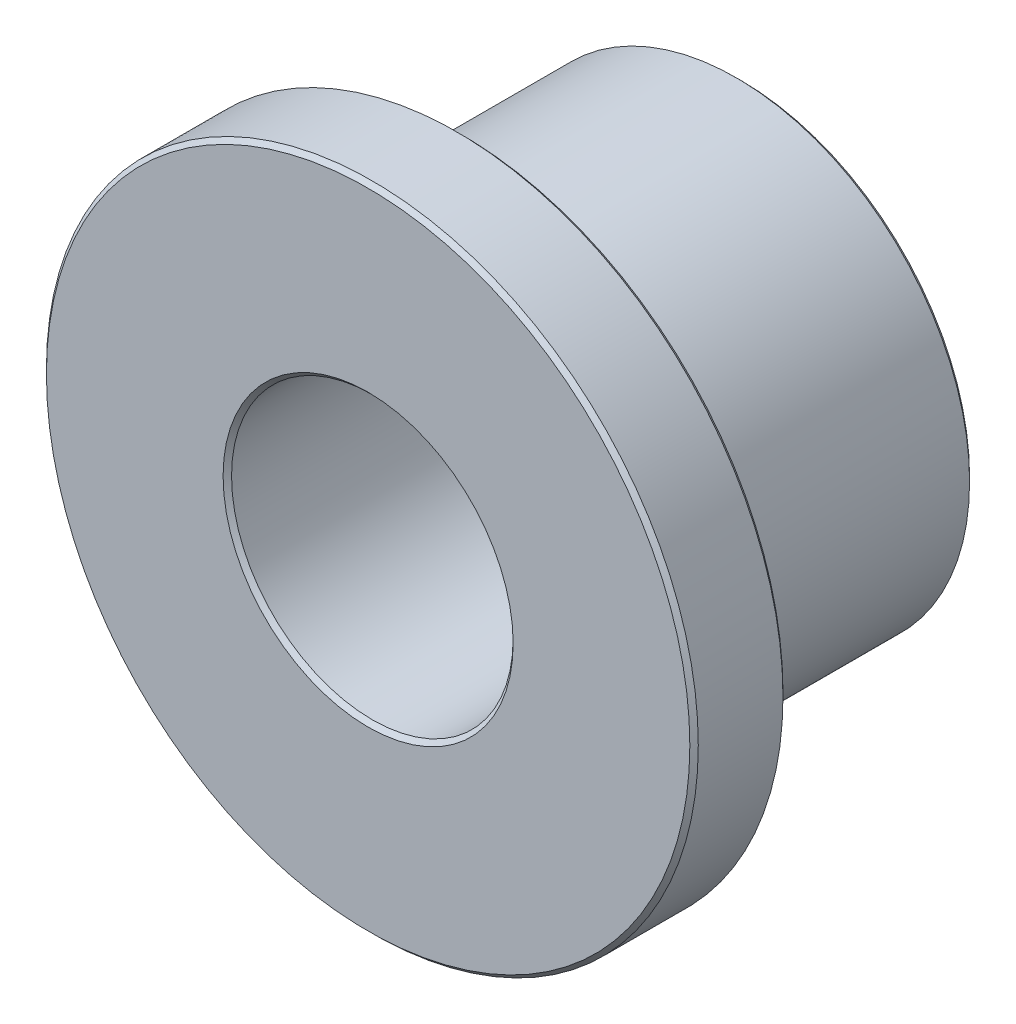
ISO-10303-21;
HEADER;
FILE_DESCRIPTION(('STEP AP214'),'2;1');
FILE_NAME('part.step','',(''),(''),'','','');
FILE_SCHEMA(('AUTOMOTIVE_DESIGN { 1 0 10303 214 1 1 1 1 }'));
ENDSEC;
DATA;
#1=APPLICATION_CONTEXT('core data for automotive mechanical design processes');
#2=APPLICATION_PROTOCOL_DEFINITION('international standard','automotive_design',2000,#1);
#3=PRODUCT_CONTEXT('',#1,'mechanical');
#4=PRODUCT('Part','Part','',(#3));
#5=PRODUCT_RELATED_PRODUCT_CATEGORY('part','',(#4));
#6=PRODUCT_DEFINITION_FORMATION('','',#4);
#7=PRODUCT_DEFINITION_CONTEXT('part definition',#1,'design');
#8=PRODUCT_DEFINITION('design','',#6,#7);
#9=PRODUCT_DEFINITION_SHAPE('','',#8);
#10=(LENGTH_UNIT() NAMED_UNIT(*) SI_UNIT(.MILLI.,.METRE.));
#11=(NAMED_UNIT(*) PLANE_ANGLE_UNIT() SI_UNIT($,.RADIAN.));
#12=(NAMED_UNIT(*) SI_UNIT($,.STERADIAN.) SOLID_ANGLE_UNIT());
#13=UNCERTAINTY_MEASURE_WITH_UNIT(LENGTH_MEASURE(1.E-05),#10,'distance_accuracy_value','');
#14=(GEOMETRIC_REPRESENTATION_CONTEXT(3) GLOBAL_UNCERTAINTY_ASSIGNED_CONTEXT((#13)) GLOBAL_UNIT_ASSIGNED_CONTEXT((#10,
#11,#12)) REPRESENTATION_CONTEXT('',''));
#15=CARTESIAN_POINT('',(0.,0.,0.));
#16=DIRECTION('',(0.,0.,1.));
#17=DIRECTION('',(1.,0.,0.));
#18=AXIS2_PLACEMENT_3D('',#15,#16,#17);
#19=CARTESIAN_POINT('',(0.,0.,1.5875));
#20=DIRECTION('',(0.,0.,1.));
#21=DIRECTION('',(1.,0.,0.));
#22=AXIS2_PLACEMENT_3D('',#19,#20,#21);
#23=CYLINDRICAL_SURFACE('',#22,5.55625);
#24=CARTESIAN_POINT('',(0.,0.,3.102991));
#25=DIRECTION('',(0.,0.,1.));
#26=DIRECTION('',(1.,0.,0.));
#27=AXIS2_PLACEMENT_3D('',#24,#25,#26);
#28=CIRCLE('',#27,5.55625);
#29=CARTESIAN_POINT('',(5.55625,0.,3.102991));
#30=VERTEX_POINT('',#29);
#31=EDGE_CURVE('E56',#30,#30,#28,.F.);
#32=ORIENTED_EDGE('',*,*,#31,.T.);
#33=EDGE_LOOP('',(#32));
#34=FACE_BOUND('',#33,.T.);
#35=CARTESIAN_POINT('',(0.,0.,1.659509));
#36=DIRECTION('',(0.,0.,1.));
#37=DIRECTION('',(1.,0.,0.));
#38=AXIS2_PLACEMENT_3D('',#35,#36,#37);
#39=CIRCLE('',#38,5.55625);
#40=CARTESIAN_POINT('',(5.55625,0.,1.659509));
#41=VERTEX_POINT('',#40);
#42=EDGE_CURVE('E59',#41,#41,#39,.T.);
#43=ORIENTED_EDGE('',*,*,#42,.T.);
#44=EDGE_LOOP('',(#43));
#45=FACE_BOUND('',#44,.T.);
#46=ADVANCED_FACE('F30',(#34,#45),#23,.T.);
#47=CARTESIAN_POINT('',(0.,0.,1.5875));
#48=DIRECTION('',(0.,0.,1.));
#49=DIRECTION('',(1.,0.,0.));
#50=AXIS2_PLACEMENT_3D('',#47,#48,#49);
#51=PLANE('',#50);
#52=CARTESIAN_POINT('',(0.,0.,1.5875));
#53=DIRECTION('',(0.,0.,1.));
#54=DIRECTION('',(1.,0.,0.));
#55=AXIS2_PLACEMENT_3D('',#52,#53,#54);
#56=CIRCLE('',#55,5.484241);
#57=CARTESIAN_POINT('',(5.484241,0.,1.5875));
#58=VERTEX_POINT('',#57);
#59=EDGE_CURVE('E50',#58,#58,#56,.F.);
#60=ORIENTED_EDGE('',*,*,#59,.T.);
#61=EDGE_LOOP('',(#60));
#62=FACE_BOUND('',#61,.T.);
#63=CARTESIAN_POINT('',(0.,0.,1.5875));
#64=DIRECTION('',(0.,0.,1.));
#65=DIRECTION('',(1.,0.,0.));
#66=AXIS2_PLACEMENT_3D('',#63,#64,#65);
#67=CIRCLE('',#66,4.047109);
#68=CARTESIAN_POINT('',(4.047109,0.,1.5875));
#69=VERTEX_POINT('',#68);
#70=EDGE_CURVE('E53',#69,#69,#67,.T.);
#71=ORIENTED_EDGE('',*,*,#70,.T.);
#72=EDGE_LOOP('',(#71));
#73=FACE_BOUND('',#72,.T.);
#74=ADVANCED_FACE('F90',(#62,#73),#51,.F.);
#75=CARTESIAN_POINT('',(0.,0.,3.175));
#76=DIRECTION('',(0.,0.,1.));
#77=DIRECTION('',(1.,0.,0.));
#78=AXIS2_PLACEMENT_3D('',#75,#76,#77);
#79=PLANE('',#78);
#80=CARTESIAN_POINT('',(0.,0.,3.175));
#81=DIRECTION('',(0.,0.,1.));
#82=DIRECTION('',(1.,0.,0.));
#83=AXIS2_PLACEMENT_3D('',#80,#81,#82);
#84=CIRCLE('',#83,2.472309);
#85=CARTESIAN_POINT('',(2.472309,0.,3.175));
#86=VERTEX_POINT('',#85);
#87=EDGE_CURVE('E62',#86,#86,#84,.F.);
#88=ORIENTED_EDGE('',*,*,#87,.T.);
#89=EDGE_LOOP('',(#88));
#90=FACE_BOUND('',#89,.T.);
#91=CARTESIAN_POINT('',(0.,0.,3.175));
#92=DIRECTION('',(0.,0.,1.));
#93=DIRECTION('',(1.,0.,0.));
#94=AXIS2_PLACEMENT_3D('',#91,#92,#93);
#95=CIRCLE('',#94,5.484241);
#96=CARTESIAN_POINT('',(5.484241,0.,3.175));
#97=VERTEX_POINT('',#96);
#98=EDGE_CURVE('E65',#97,#97,#95,.T.);
#99=ORIENTED_EDGE('',*,*,#98,.T.);
#100=EDGE_LOOP('',(#99));
#101=FACE_BOUND('',#100,.T.);
#102=ADVANCED_FACE('F96',(#90,#101),#79,.T.);
#103=CARTESIAN_POINT('',(0.,0.,1.5875));
#104=DIRECTION('',(0.,0.,1.));
#105=DIRECTION('',(1.,0.,0.));
#106=AXIS2_PLACEMENT_3D('',#103,#104,#105);
#107=CYLINDRICAL_SURFACE('',#106,2.4003);
#108=CARTESIAN_POINT('',(0.,0.,3.102991));
#109=DIRECTION('',(0.,0.,1.));
#110=DIRECTION('',(1.,0.,0.));
#111=AXIS2_PLACEMENT_3D('',#108,#109,#110);
#112=CIRCLE('',#111,2.4003);
#113=CARTESIAN_POINT('',(2.4003,0.,3.102991));
#114=VERTEX_POINT('',#113);
#115=EDGE_CURVE('E68',#114,#114,#112,.T.);
#116=ORIENTED_EDGE('',*,*,#115,.T.);
#117=EDGE_LOOP('',(#116));
#118=FACE_BOUND('',#117,.T.);
#119=CARTESIAN_POINT('',(0.,0.,-3.102991));
#120=DIRECTION('',(0.,0.,1.));
#121=DIRECTION('',(1.,0.,0.));
#122=AXIS2_PLACEMENT_3D('',#119,#120,#121);
#123=CIRCLE('',#122,2.4003);
#124=CARTESIAN_POINT('',(2.4003,0.,-3.102991));
#125=VERTEX_POINT('',#124);
#126=EDGE_CURVE('E71',#125,#125,#123,.F.);
#127=ORIENTED_EDGE('',*,*,#126,.T.);
#128=EDGE_LOOP('',(#127));
#129=FACE_BOUND('',#128,.T.);
#130=ADVANCED_FACE('F75',(#118,#129),#107,.F.);
#131=CARTESIAN_POINT('',(0.,0.,-3.175));
#132=DIRECTION('',(0.,0.,1.));
#133=DIRECTION('',(1.,0.,0.));
#134=AXIS2_PLACEMENT_3D('',#131,#132,#133);
#135=CYLINDRICAL_SURFACE('',#134,3.9751);
#136=CARTESIAN_POINT('',(0.,0.,1.515491));
#137=DIRECTION('',(0.,0.,1.));
#138=DIRECTION('',(1.,0.,0.));
#139=AXIS2_PLACEMENT_3D('',#136,#137,#138);
#140=CIRCLE('',#139,3.9751);
#141=CARTESIAN_POINT('',(3.9751,0.,1.515491));
#142=VERTEX_POINT('',#141);
#143=EDGE_CURVE('E41',#142,#142,#140,.F.);
#144=CARTESIAN_POINT('',(0.,0.,-3.10299099999999));
#145=DIRECTION('',(0.,0.,1.));
#146=DIRECTION('',(1.,0.,0.));
#147=AXIS2_PLACEMENT_3D('',#144,#145,#146);
#148=CIRCLE('',#147,3.9751);
#149=CARTESIAN_POINT('',(3.9751,0.,-3.10299099999999));
#150=VERTEX_POINT('',#149);
#151=EDGE_CURVE('E45',#150,#150,#148,.T.);
#152=CARTESIAN_POINT('',(3.9751,0.,1.515491));
#153=CARTESIAN_POINT('',(3.9751,0.,1.4673818125));
#154=CARTESIAN_POINT('',(3.9751,0.,1.419272625));
#155=CARTESIAN_POINT('',(3.9751,0.,1.32305425));
#156=CARTESIAN_POINT('',(3.9751,0.,1.2749450625));
#157=CARTESIAN_POINT('',(3.9751,0.,1.1787266875));
#158=CARTESIAN_POINT('',(3.9751,0.,1.1306175));
#159=CARTESIAN_POINT('',(3.9751,0.,1.034399125));
#160=CARTESIAN_POINT('',(3.9751,0.,0.986289937500003));
#161=CARTESIAN_POINT('',(3.9751,0.,0.890071562500003));
#162=CARTESIAN_POINT('',(3.9751,0.,0.841962375000003));
#163=CARTESIAN_POINT('',(3.9751,0.,0.745744000000004));
#164=CARTESIAN_POINT('',(3.9751,0.,0.697634812500004));
#165=CARTESIAN_POINT('',(3.9751,0.,0.601416437500004));
#166=CARTESIAN_POINT('',(3.9751,0.,0.553307250000004));
#167=CARTESIAN_POINT('',(3.9751,0.,0.457088875000004));
#168=CARTESIAN_POINT('',(3.9751,0.,0.408979687500004));
#169=CARTESIAN_POINT('',(3.9751,0.,0.312761312500004));
#170=CARTESIAN_POINT('',(3.9751,0.,0.264652125000004));
#171=CARTESIAN_POINT('',(3.9751,0.,0.168433750000004));
#172=CARTESIAN_POINT('',(3.9751,0.,0.120324562500004));
#173=CARTESIAN_POINT('',(3.9751,0.,0.0241061875000043));
#174=CARTESIAN_POINT('',(3.9751,0.,-0.0240029999999957));
#175=CARTESIAN_POINT('',(3.9751,0.,-0.120221374999996));
#176=CARTESIAN_POINT('',(3.9751,0.,-0.168330562499995));
#177=CARTESIAN_POINT('',(3.9751,0.,-0.264548937499995));
#178=CARTESIAN_POINT('',(3.9751,0.,-0.312658124999996));
#179=CARTESIAN_POINT('',(3.9751,0.,-0.408876499999996));
#180=CARTESIAN_POINT('',(3.9751,0.,-0.456985687499996));
#181=CARTESIAN_POINT('',(3.9751,0.,-0.553204062499995));
#182=CARTESIAN_POINT('',(3.9751,0.,-0.601313249999996));
#183=CARTESIAN_POINT('',(3.9751,0.,-0.697531624999996));
#184=CARTESIAN_POINT('',(3.9751,0.,-0.745640812499995));
#185=CARTESIAN_POINT('',(3.9751,0.,-0.841859187499995));
#186=CARTESIAN_POINT('',(3.9751,0.,-0.889968374999995));
#187=CARTESIAN_POINT('',(3.9751,0.,-0.986186749999995));
#188=CARTESIAN_POINT('',(3.9751,0.,-1.0342959375));
#189=CARTESIAN_POINT('',(3.9751,0.,-1.1305143125));
#190=CARTESIAN_POINT('',(3.9751,0.,-1.1786235));
#191=CARTESIAN_POINT('',(3.9751,0.,-1.274841875));
#192=CARTESIAN_POINT('',(3.9751,0.,-1.3229510625));
#193=CARTESIAN_POINT('',(3.9751,0.,-1.4191694375));
#194=CARTESIAN_POINT('',(3.9751,0.,-1.467278625));
#195=CARTESIAN_POINT('',(3.9751,0.,-1.56349699999999));
#196=CARTESIAN_POINT('',(3.9751,0.,-1.61160618749999));
#197=CARTESIAN_POINT('',(3.9751,0.,-1.70782456249999));
#198=CARTESIAN_POINT('',(3.9751,0.,-1.75593374999999));
#199=CARTESIAN_POINT('',(3.9751,0.,-1.85215212499999));
#200=CARTESIAN_POINT('',(3.9751,0.,-1.90026131249999));
#201=CARTESIAN_POINT('',(3.9751,0.,-1.99647968749999));
#202=CARTESIAN_POINT('',(3.9751,0.,-2.04458887499999));
#203=CARTESIAN_POINT('',(3.9751,0.,-2.14080724999999));
#204=CARTESIAN_POINT('',(3.9751,0.,-2.18891643749999));
#205=CARTESIAN_POINT('',(3.9751,0.,-2.28513481249999));
#206=CARTESIAN_POINT('',(3.9751,0.,-2.33324399999999));
#207=CARTESIAN_POINT('',(3.9751,0.,-2.42946237499999));
#208=CARTESIAN_POINT('',(3.9751,0.,-2.47757156249999));
#209=CARTESIAN_POINT('',(3.9751,0.,-2.57378993749999));
#210=CARTESIAN_POINT('',(3.9751,0.,-2.62189912499999));
#211=CARTESIAN_POINT('',(3.9751,0.,-2.71811749999999));
#212=CARTESIAN_POINT('',(3.9751,0.,-2.76622668749999));
#213=CARTESIAN_POINT('',(3.9751,0.,-2.86244506249999));
#214=CARTESIAN_POINT('',(3.9751,0.,-2.91055424999999));
#215=CARTESIAN_POINT('',(3.9751,0.,-3.00677262499999));
#216=CARTESIAN_POINT('',(3.9751,0.,-3.05488181249999));
#217=CARTESIAN_POINT('',(3.9751,0.,-3.10299099999999));
#218=B_SPLINE_CURVE_WITH_KNOTS('',3,(#152,#153,#154,#155,#156,#157,#158,#159,#160,#161,#162,
#163,#164,#165,#166,#167,#168,#169,#170,#171,#172,#173,#174,#175,#176,#177,#178,#179,#180,#181,
#182,#183,#184,#185,#186,#187,#188,#189,#190,#191,#192,#193,#194,#195,#196,#197,#198,#199,#200,
#201,#202,#203,#204,#205,#206,#207,#208,#209,#210,#211,#212,#213,#214,#215,#216,#217),
.UNSPECIFIED.,.F.,.F.,(4,2,2,2,2,2,2,2,2,2,2,2,2,2,2,2,2,2,2,2,2,2,2,2,2,2,2,2,2,2,2,2,4),(0.,
0.1443275625,0.288655125,0.4329826875,0.57731025,0.7216378125,0.865965374999999,1.0102929375,
1.1546205,1.2989480625,1.443275625,1.5876031875,1.73193075,1.8762583125,2.020585875,
2.1649134375,2.309241,2.4535685625,2.597896125,2.7422236875,2.88655125,3.0308788125,3.175206375,
3.3195339375,3.4638615,3.6081890625,3.752516625,3.8968441875,4.04117175,4.1854993125,
4.329826875,4.4741544375,4.618482),.UNSPECIFIED.);
#219=EDGE_CURVE('BSEAM158',#142,#150,#218,.T.);
#220=ORIENTED_EDGE('',*,*,#143,.T.);
#221=ORIENTED_EDGE('',*,*,#151,.T.);
#222=ORIENTED_EDGE('',*,*,#219,.T.);
#223=ORIENTED_EDGE('',*,*,#219,.F.);
#224=EDGE_LOOP('',(#220,#222,#221,#223));
#225=FACE_BOUND('',#224,.T.);
#226=ADVANCED_FACE('F158',(#225),#135,.T.);
#227=CARTESIAN_POINT('',(0.,0.,-3.175));
#228=DIRECTION('',(0.,0.,1.));
#229=DIRECTION('',(1.,0.,0.));
#230=AXIS2_PLACEMENT_3D('',#227,#228,#229);
#231=PLANE('',#230);
#232=CARTESIAN_POINT('',(0.,0.,-3.175));
#233=DIRECTION('',(0.,0.,1.));
#234=DIRECTION('',(1.,0.,0.));
#235=AXIS2_PLACEMENT_3D('',#232,#233,#234);
#236=CIRCLE('',#235,2.472309);
#237=CARTESIAN_POINT('',(2.472309,0.,-3.175));
#238=VERTEX_POINT('',#237);
#239=EDGE_CURVE('E10',#238,#238,#236,.T.);
#240=ORIENTED_EDGE('',*,*,#239,.T.);
#241=EDGE_LOOP('',(#240));
#242=FACE_BOUND('',#241,.T.);
#243=CARTESIAN_POINT('',(0.,0.,-3.175));
#244=DIRECTION('',(0.,0.,1.));
#245=DIRECTION('',(1.,0.,0.));
#246=AXIS2_PLACEMENT_3D('',#243,#244,#245);
#247=CIRCLE('',#246,3.90309099999999);
#248=CARTESIAN_POINT('',(3.90309099999999,0.,-3.175));
#249=VERTEX_POINT('',#248);
#250=EDGE_CURVE('E37',#249,#249,#247,.F.);
#251=ORIENTED_EDGE('',*,*,#250,.T.);
#252=EDGE_LOOP('',(#251));
#253=FACE_BOUND('',#252,.T.);
#254=ADVANCED_FACE('F106',(#242,#253),#231,.F.);
#255=CARTESIAN_POINT('',(0.,0.,3.102991));
#256=DIRECTION('',(0.,0.,1.));
#257=DIRECTION('',(1.,0.,0.));
#258=AXIS2_PLACEMENT_3D('',#255,#256,#257);
#259=CONICAL_SURFACE('',#258,2.4003,0.785398163397463);
#260=ORIENTED_EDGE('',*,*,#87,.F.);
#261=EDGE_LOOP('',(#260));
#262=FACE_BOUND('',#261,.T.);
#263=ORIENTED_EDGE('',*,*,#115,.F.);
#264=EDGE_LOOP('',(#263));
#265=FACE_BOUND('',#264,.T.);
#266=ADVANCED_FACE('F102',(#262,#265),#259,.F.);
#267=CARTESIAN_POINT('',(0.,0.,3.175));
#268=DIRECTION('',(0.,0.,-1.));
#269=DIRECTION('',(-1.,0.,0.));
#270=AXIS2_PLACEMENT_3D('',#267,#268,#269);
#271=CONICAL_SURFACE('',#270,5.484241,0.785398163397436);
#272=ORIENTED_EDGE('',*,*,#31,.F.);
#273=EDGE_LOOP('',(#272));
#274=FACE_BOUND('',#273,.T.);
#275=ORIENTED_EDGE('',*,*,#98,.F.);
#276=EDGE_LOOP('',(#275));
#277=FACE_BOUND('',#276,.T.);
#278=ADVANCED_FACE('F105',(#274,#277),#271,.T.);
#279=CARTESIAN_POINT('',(0.,0.,1.659509));
#280=DIRECTION('',(0.,0.,1.));
#281=DIRECTION('',(1.,0.,0.));
#282=AXIS2_PLACEMENT_3D('',#279,#280,#281);
#283=CONICAL_SURFACE('',#282,5.55625,0.785398163397442);
#284=ORIENTED_EDGE('',*,*,#59,.F.);
#285=EDGE_LOOP('',(#284));
#286=FACE_BOUND('',#285,.T.);
#287=ORIENTED_EDGE('',*,*,#42,.F.);
#288=EDGE_LOOP('',(#287));
#289=FACE_BOUND('',#288,.T.);
#290=ADVANCED_FACE('F86',(#286,#289),#283,.T.);
#291=CARTESIAN_POINT('',(0.,0.,1.5875));
#292=DIRECTION('',(0.,0.,1.));
#293=DIRECTION('',(1.,0.,0.));
#294=AXIS2_PLACEMENT_3D('',#291,#292,#293);
#295=CONICAL_SURFACE('',#294,4.047109,0.785398163397448);
#296=ORIENTED_EDGE('',*,*,#143,.F.);
#297=EDGE_LOOP('',(#296));
#298=FACE_BOUND('',#297,.T.);
#299=ORIENTED_EDGE('',*,*,#70,.F.);
#300=EDGE_LOOP('',(#299));
#301=FACE_BOUND('',#300,.T.);
#302=ADVANCED_FACE('F80',(#298,#301),#295,.T.);
#303=CARTESIAN_POINT('',(0.,0.,-3.175));
#304=DIRECTION('',(0.,0.,-1.));
#305=DIRECTION('',(-1.,0.,0.));
#306=AXIS2_PLACEMENT_3D('',#303,#304,#305);
#307=CONICAL_SURFACE('',#306,2.472309,0.785398163397448);
#308=ORIENTED_EDGE('',*,*,#126,.F.);
#309=EDGE_LOOP('',(#308));
#310=FACE_BOUND('',#309,.T.);
#311=ORIENTED_EDGE('',*,*,#239,.F.);
#312=EDGE_LOOP('',(#311));
#313=FACE_BOUND('',#312,.T.);
#314=ADVANCED_FACE('F77',(#310,#313),#307,.F.);
#315=CARTESIAN_POINT('',(0.,0.,-3.10299099999999));
#316=DIRECTION('',(0.,0.,1.));
#317=DIRECTION('',(1.,0.,0.));
#318=AXIS2_PLACEMENT_3D('',#315,#316,#317);
#319=CONICAL_SURFACE('',#318,3.9751,0.785398163397454);
#320=ORIENTED_EDGE('',*,*,#250,.F.);
#321=EDGE_LOOP('',(#320));
#322=FACE_BOUND('',#321,.T.);
#323=ORIENTED_EDGE('',*,*,#151,.F.);
#324=EDGE_LOOP('',(#323));
#325=FACE_BOUND('',#324,.T.);
#326=ADVANCED_FACE('F32',(#322,#325),#319,.T.);
#327=CLOSED_SHELL('',(#46,#74,#102,#130,#226,#254,#266,#278,#290,#302,#314,#326));
#328=MANIFOLD_SOLID_BREP('B2',#327);
#329=ADVANCED_BREP_SHAPE_REPRESENTATION('',(#18,#328),#14);
#330=SHAPE_DEFINITION_REPRESENTATION(#9,#329);
ENDSEC;
END-ISO-10303-21;
